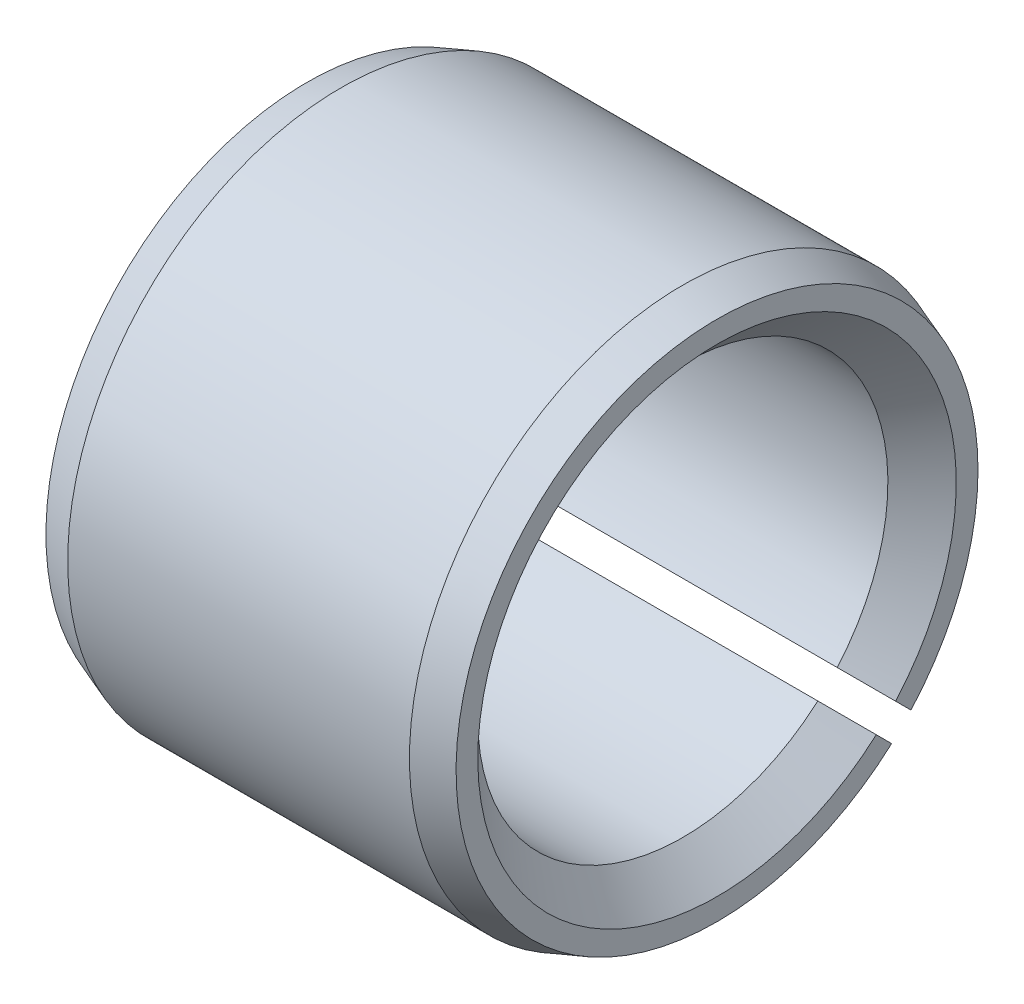
ISO-10303-21;
HEADER;
FILE_DESCRIPTION(('STEP AP214'),'2;1');
FILE_NAME('part.step','',(''),(''),'','','');
FILE_SCHEMA(('AUTOMOTIVE_DESIGN { 1 0 10303 214 1 1 1 1 }'));
ENDSEC;
DATA;
#1=APPLICATION_CONTEXT('core data for automotive mechanical design processes');
#2=APPLICATION_PROTOCOL_DEFINITION('international standard','automotive_design',2000,#1);
#3=PRODUCT_CONTEXT('',#1,'mechanical');
#4=PRODUCT('Part','Part','',(#3));
#5=PRODUCT_RELATED_PRODUCT_CATEGORY('part','',(#4));
#6=PRODUCT_DEFINITION_FORMATION('','',#4);
#7=PRODUCT_DEFINITION_CONTEXT('part definition',#1,'design');
#8=PRODUCT_DEFINITION('design','',#6,#7);
#9=PRODUCT_DEFINITION_SHAPE('','',#8);
#10=(LENGTH_UNIT() NAMED_UNIT(*) SI_UNIT(.MILLI.,.METRE.));
#11=(NAMED_UNIT(*) PLANE_ANGLE_UNIT() SI_UNIT($,.RADIAN.));
#12=(NAMED_UNIT(*) SI_UNIT($,.STERADIAN.) SOLID_ANGLE_UNIT());
#13=UNCERTAINTY_MEASURE_WITH_UNIT(LENGTH_MEASURE(1.E-05),#10,'distance_accuracy_value','');
#14=(GEOMETRIC_REPRESENTATION_CONTEXT(3) GLOBAL_UNCERTAINTY_ASSIGNED_CONTEXT((#13)) GLOBAL_UNIT_ASSIGNED_CONTEXT((#10,
#11,#12)) REPRESENTATION_CONTEXT('',''));
#15=CARTESIAN_POINT('',(0.,0.,0.));
#16=DIRECTION('',(0.,0.,1.));
#17=DIRECTION('',(1.,0.,0.));
#18=AXIS2_PLACEMENT_3D('',#15,#16,#17);
#19=CARTESIAN_POINT('',(0.5,0.,0.));
#20=DIRECTION('',(1.,0.,0.));
#21=DIRECTION('',(0.,0.,-1.));
#22=AXIS2_PLACEMENT_3D('',#19,#20,#21);
#23=CONICAL_SURFACE('',#22,4.,0.349065850398865);
#24=CARTESIAN_POINT('',(0.5,0.,0.));
#25=DIRECTION('',(1.,0.,0.));
#26=DIRECTION('',(0.,0.,-1.));
#27=AXIS2_PLACEMENT_3D('',#24,#25,#26);
#28=CIRCLE('',#27,4.);
#29=CARTESIAN_POINT('',(0.5,-2.6834680221278,-2.96631073460242));
#30=VERTEX_POINT('',#29);
#31=CARTESIAN_POINT('',(0.5,-2.96631073460242,-2.6834680221278));
#32=VERTEX_POINT('',#31);
#33=EDGE_CURVE('E39',#30,#32,#28,.T.);
#34=ORIENTED_EDGE('',*,*,#33,.F.);
#35=CARTESIAN_POINT('',(0.5,-2.6834680221278,-2.96631073460242));
#36=CARTESIAN_POINT('',(0.333332166032816,-2.64051969923893,-2.92336241171355));
#37=CARTESIAN_POINT('',(0.166665443594881,-2.59756921974541,-2.88041193222003));
#38=CARTESIAN_POINT('',(0.,-2.55461625902264,-2.83745897149726));
#39=(BOUNDED_CURVE() B_SPLINE_CURVE(3,(#35,#36,#37,#38),.UNSPECIFIED.,.F.,
.F.) B_SPLINE_CURVE_WITH_KNOTS((4,4),(2.12866750886404E-07,0.000532383472581962),
.UNSPECIFIED.) CURVE() GEOMETRIC_REPRESENTATION_ITEM() RATIONAL_B_SPLINE_CURVE((1.,1.,1.,1.)) REPRESENTATION_ITEM(''));
#40=CARTESIAN_POINT('',(0.,-2.55461625902264,-2.83745897149726));
#41=VERTEX_POINT('',#40);
#42=EDGE_CURVE('E11',#30,#41,#39,.T.);
#43=ORIENTED_EDGE('',*,*,#42,.T.);
#44=CARTESIAN_POINT('',(0.,0.,0.));
#45=DIRECTION('',(1.,0.,0.));
#46=DIRECTION('',(0.,0.,-1.));
#47=AXIS2_PLACEMENT_3D('',#44,#45,#46);
#48=CIRCLE('',#47,3.8180148828669);
#49=CARTESIAN_POINT('',(0.,-2.83745897149726,-2.55461625902264));
#50=VERTEX_POINT('',#49);
#51=EDGE_CURVE('E27',#41,#50,#48,.T.);
#52=ORIENTED_EDGE('',*,*,#51,.T.);
#53=CARTESIAN_POINT('',(0.,-2.83745897149726,-2.55461625902264));
#54=CARTESIAN_POINT('',(0.166665443594881,-2.88041193222003,-2.59756921974541));
#55=CARTESIAN_POINT('',(0.333332166032816,-2.92336241171355,-2.64051969923893));
#56=CARTESIAN_POINT('',(0.5,-2.96631073460242,-2.6834680221278));
#57=(BOUNDED_CURVE() B_SPLINE_CURVE(3,(#53,#54,#55,#56),.UNSPECIFIED.,.F.,
.F.) B_SPLINE_CURVE_WITH_KNOTS((4,4),(2.12869805117319E-07,0.000532383475636193),
.UNSPECIFIED.) CURVE() GEOMETRIC_REPRESENTATION_ITEM() RATIONAL_B_SPLINE_CURVE((1.,1.,1.,1.)) REPRESENTATION_ITEM(''));
#58=EDGE_CURVE('E169',#50,#32,#57,.T.);
#59=ORIENTED_EDGE('',*,*,#58,.T.);
#60=EDGE_LOOP('',(#34,#43,#52,#59));
#61=FACE_BOUND('',#60,.T.);
#62=ADVANCED_FACE('F16',(#61),#23,.T.);
#63=CARTESIAN_POINT('',(0.,3.8180148828669,0.));
#64=DIRECTION('',(-1.,0.,0.));
#65=DIRECTION('',(0.,0.,1.));
#66=AXIS2_PLACEMENT_3D('',#63,#64,#65);
#67=PLANE('',#66);
#68=ORIENTED_EDGE('',*,*,#51,.F.);
#69=DIRECTION('',(0.,0.707106781186547,0.707106781186548));
#70=VECTOR('',#69,1.);
#71=CARTESIAN_POINT('',(0.,-5.51543289325507,-5.79827560572969));
#72=LINE('',#71,#70);
#73=CARTESIAN_POINT('',(0.,-2.32940846388386,-2.61225117635848));
#74=VERTEX_POINT('',#73);
#75=EDGE_CURVE('E128',#41,#74,#72,.T.);
#76=ORIENTED_EDGE('',*,*,#75,.T.);
#77=CARTESIAN_POINT('',(0.,0.,0.));
#78=DIRECTION('',(1.,0.,0.));
#79=DIRECTION('',(0.,0.,-1.));
#80=AXIS2_PLACEMENT_3D('',#77,#78,#79);
#81=CIRCLE('',#80,3.5);
#82=CARTESIAN_POINT('',(0.,-2.61225117635848,-2.32940846388386));
#83=VERTEX_POINT('',#82);
#84=EDGE_CURVE('E121',#74,#83,#81,.T.);
#85=ORIENTED_EDGE('',*,*,#84,.T.);
#86=DIRECTION('',(0.,-0.707106781186548,-0.707106781186547));
#87=VECTOR('',#86,1.);
#88=CARTESIAN_POINT('',(0.,-0.141421356237309,0.141421356237309));
#89=LINE('',#88,#87);
#90=EDGE_CURVE('E129',#83,#50,#89,.T.);
#91=ORIENTED_EDGE('',*,*,#90,.T.);
#92=EDGE_LOOP('',(#68,#76,#85,#91));
#93=FACE_BOUND('',#92,.T.);
#94=ADVANCED_FACE('F182',(#93),#67,.T.);
#95=CARTESIAN_POINT('',(0.,0.,0.));
#96=DIRECTION('',(-1.,0.,0.));
#97=DIRECTION('',(0.,0.,1.));
#98=AXIS2_PLACEMENT_3D('',#95,#96,#97);
#99=CONICAL_SURFACE('',#98,3.5,0.785398163397448);
#100=ORIENTED_EDGE('',*,*,#84,.F.);
#101=CARTESIAN_POINT('',(0.,-2.32940846388386,-2.61225117635848));
#102=CARTESIAN_POINT('',(0.166689557115198,-2.21134823870117,-2.49419095117579));
#103=CARTESIAN_POINT('',(0.333360046715191,-2.09327465909982,-2.37611737157444));
#104=CARTESIAN_POINT('',(0.5,-1.97517969261436,-2.25802240508898));
#105=(BOUNDED_CURVE() B_SPLINE_CURVE(3,(#101,#102,#103,#104),.UNSPECIFIED.,.F.,
.F.) B_SPLINE_CURVE_WITH_KNOTS((4,4),(9.90751980755594E-07,0.000708768049468819),
.UNSPECIFIED.) CURVE() GEOMETRIC_REPRESENTATION_ITEM() RATIONAL_B_SPLINE_CURVE((1.,1.,1.,1.)) REPRESENTATION_ITEM(''));
#106=CARTESIAN_POINT('',(0.5,-1.97517969261436,-2.25802240508898));
#107=VERTEX_POINT('',#106);
#108=EDGE_CURVE('E149',#74,#107,#105,.T.);
#109=ORIENTED_EDGE('',*,*,#108,.T.);
#110=CARTESIAN_POINT('',(0.5,0.,0.));
#111=DIRECTION('',(1.,0.,0.));
#112=DIRECTION('',(0.,0.,-1.));
#113=AXIS2_PLACEMENT_3D('',#110,#111,#112);
#114=CIRCLE('',#113,3.);
#115=CARTESIAN_POINT('',(0.5,-2.25802240508898,-1.97517969261436));
#116=VERTEX_POINT('',#115);
#117=EDGE_CURVE('E119',#107,#116,#114,.T.);
#118=ORIENTED_EDGE('',*,*,#117,.T.);
#119=CARTESIAN_POINT('',(0.5,-2.25802240508898,-1.97517969261436));
#120=CARTESIAN_POINT('',(0.333359948184679,-2.37611744140137,-2.09327472892675));
#121=CARTESIAN_POINT('',(0.166689472660281,-2.49419101099218,-2.21134829851756));
#122=CARTESIAN_POINT('',(0.,-2.61225117635848,-2.32940846388386));
#123=(BOUNDED_CURVE() B_SPLINE_CURVE(3,(#119,#120,#121,#122),.UNSPECIFIED.,.F.,
.F.) B_SPLINE_CURVE_WITH_KNOTS((4,4),(0.0041340243565896,0.00484453819835573),
.UNSPECIFIED.) CURVE() GEOMETRIC_REPRESENTATION_ITEM() RATIONAL_B_SPLINE_CURVE((1.,1.,1.,1.)) REPRESENTATION_ITEM(''));
#124=EDGE_CURVE('E113',#116,#83,#123,.T.);
#125=ORIENTED_EDGE('',*,*,#124,.T.);
#126=EDGE_LOOP('',(#100,#109,#118,#125));
#127=FACE_BOUND('',#126,.T.);
#128=ADVANCED_FACE('F234',(#127),#99,.F.);
#129=CARTESIAN_POINT('',(6.,0.,0.));
#130=DIRECTION('',(1.,0.,0.));
#131=DIRECTION('',(0.,0.,-1.));
#132=AXIS2_PLACEMENT_3D('',#129,#130,#131);
#133=CYLINDRICAL_SURFACE('',#132,3.);
#134=ORIENTED_EDGE('',*,*,#117,.F.);
#135=DIRECTION('',(1.,0.,0.));
#136=VECTOR('',#135,1.);
#137=CARTESIAN_POINT('',(6.,-1.97517969261436,-2.25802240508898));
#138=LINE('',#137,#136);
#139=CARTESIAN_POINT('',(5.5,-1.97517969261436,-2.25802240508898));
#140=VERTEX_POINT('',#139);
#141=EDGE_CURVE('E120',#107,#140,#138,.T.);
#142=ORIENTED_EDGE('',*,*,#141,.T.);
#143=CARTESIAN_POINT('',(5.5,0.,0.));
#144=DIRECTION('',(1.,0.,0.));
#145=DIRECTION('',(0.,0.,-1.));
#146=AXIS2_PLACEMENT_3D('',#143,#144,#145);
#147=CIRCLE('',#146,3.);
#148=CARTESIAN_POINT('',(5.5,-2.25802240508898,-1.97517969261436));
#149=VERTEX_POINT('',#148);
#150=EDGE_CURVE('E175',#140,#149,#147,.T.);
#151=ORIENTED_EDGE('',*,*,#150,.T.);
#152=DIRECTION('',(-1.,0.,0.));
#153=VECTOR('',#152,1.);
#154=CARTESIAN_POINT('',(6.,-2.25802240508898,-1.97517969261436));
#155=LINE('',#154,#153);
#156=EDGE_CURVE('E205',#149,#116,#155,.T.);
#157=ORIENTED_EDGE('',*,*,#156,.T.);
#158=EDGE_LOOP('',(#134,#142,#151,#157));
#159=FACE_BOUND('',#158,.T.);
#160=ADVANCED_FACE('F243',(#159),#133,.F.);
#161=CARTESIAN_POINT('',(5.5,0.,0.));
#162=DIRECTION('',(1.,0.,0.));
#163=DIRECTION('',(0.,0.,-1.));
#164=AXIS2_PLACEMENT_3D('',#161,#162,#163);
#165=CONICAL_SURFACE('',#164,3.,0.785398163397448);
#166=ORIENTED_EDGE('',*,*,#150,.F.);
#167=CARTESIAN_POINT('',(5.5,-1.97517969261436,-2.25802240508898));
#168=CARTESIAN_POINT('',(5.66664005181532,-2.09327472892675,-2.37611744140137));
#169=CARTESIAN_POINT('',(5.83331052733972,-2.21134829851756,-2.49419101099218));
#170=CARTESIAN_POINT('',(6.,-2.32940846388386,-2.61225117635848));
#171=(BOUNDED_CURVE() B_SPLINE_CURVE(3,(#167,#168,#169,#170),.UNSPECIFIED.,.F.,
.F.) B_SPLINE_CURVE_WITH_KNOTS((4,4),(0.0041340243565896,0.00484453819835574),
.UNSPECIFIED.) CURVE() GEOMETRIC_REPRESENTATION_ITEM() RATIONAL_B_SPLINE_CURVE((1.,1.,1.,1.)) REPRESENTATION_ITEM(''));
#172=CARTESIAN_POINT('',(6.,-2.32940846388386,-2.61225117635848));
#173=VERTEX_POINT('',#172);
#174=EDGE_CURVE('E134',#140,#173,#171,.T.);
#175=ORIENTED_EDGE('',*,*,#174,.T.);
#176=CARTESIAN_POINT('',(6.,0.,0.));
#177=DIRECTION('',(1.,0.,0.));
#178=DIRECTION('',(0.,0.,-1.));
#179=AXIS2_PLACEMENT_3D('',#176,#177,#178);
#180=CIRCLE('',#179,3.5);
#181=CARTESIAN_POINT('',(6.,-2.61225117635848,-2.32940846388386));
#182=VERTEX_POINT('',#181);
#183=EDGE_CURVE('E130',#173,#182,#180,.T.);
#184=ORIENTED_EDGE('',*,*,#183,.T.);
#185=CARTESIAN_POINT('',(6.,-2.61225117635848,-2.32940846388386));
#186=CARTESIAN_POINT('',(5.8333104428848,-2.49419095117579,-2.21134823870117));
#187=CARTESIAN_POINT('',(5.66663995328481,-2.37611737157444,-2.09327465909982));
#188=CARTESIAN_POINT('',(5.5,-2.25802240508898,-1.97517969261436));
#189=(BOUNDED_CURVE() B_SPLINE_CURVE(3,(#185,#186,#187,#188),.UNSPECIFIED.,.F.,
.F.) B_SPLINE_CURVE_WITH_KNOTS((4,4),(9.90751980755632E-07,0.000708768049468819),
.UNSPECIFIED.) CURVE() GEOMETRIC_REPRESENTATION_ITEM() RATIONAL_B_SPLINE_CURVE((1.,1.,1.,1.)) REPRESENTATION_ITEM(''));
#190=EDGE_CURVE('E135',#182,#149,#189,.T.);
#191=ORIENTED_EDGE('',*,*,#190,.T.);
#192=EDGE_LOOP('',(#166,#175,#184,#191));
#193=FACE_BOUND('',#192,.T.);
#194=ADVANCED_FACE('F264',(#193),#165,.F.);
#195=CARTESIAN_POINT('',(6.,3.5,0.));
#196=DIRECTION('',(1.,0.,0.));
#197=DIRECTION('',(0.,1.,0.));
#198=AXIS2_PLACEMENT_3D('',#195,#196,#197);
#199=PLANE('',#198);
#200=ORIENTED_EDGE('',*,*,#183,.F.);
#201=DIRECTION('',(0.,0.707106781186547,0.707106781186548));
#202=VECTOR('',#201,1.);
#203=CARTESIAN_POINT('',(6.,-5.51543289325507,-5.79827560572969));
#204=LINE('',#203,#202);
#205=CARTESIAN_POINT('',(6.,-2.55461625902264,-2.83745897149726));
#206=VERTEX_POINT('',#205);
#207=EDGE_CURVE('E101',#206,#173,#204,.T.);
#208=ORIENTED_EDGE('',*,*,#207,.F.);
#209=CARTESIAN_POINT('',(6.,0.,0.));
#210=DIRECTION('',(1.,0.,0.));
#211=DIRECTION('',(0.,0.,-1.));
#212=AXIS2_PLACEMENT_3D('',#209,#210,#211);
#213=CIRCLE('',#212,3.8180148828669);
#214=CARTESIAN_POINT('',(6.,-2.83745897149726,-2.55461625902264));
#215=VERTEX_POINT('',#214);
#216=EDGE_CURVE('E141',#206,#215,#213,.T.);
#217=ORIENTED_EDGE('',*,*,#216,.T.);
#218=DIRECTION('',(0.,-0.707106781186548,-0.707106781186547));
#219=VECTOR('',#218,1.);
#220=CARTESIAN_POINT('',(6.,-0.141421356237309,0.141421356237309));
#221=LINE('',#220,#219);
#222=EDGE_CURVE('E82',#182,#215,#221,.T.);
#223=ORIENTED_EDGE('',*,*,#222,.F.);
#224=EDGE_LOOP('',(#200,#208,#217,#223));
#225=FACE_BOUND('',#224,.T.);
#226=ADVANCED_FACE('F269',(#225),#199,.T.);
#227=CARTESIAN_POINT('',(6.,0.,0.));
#228=DIRECTION('',(-1.,0.,0.));
#229=DIRECTION('',(0.,0.,1.));
#230=AXIS2_PLACEMENT_3D('',#227,#228,#229);
#231=CONICAL_SURFACE('',#230,3.8180148828669,0.349065850398865);
#232=ORIENTED_EDGE('',*,*,#216,.F.);
#233=CARTESIAN_POINT('',(6.,-2.55461625902264,-2.83745897149726));
#234=CARTESIAN_POINT('',(5.83333455640512,-2.59756921974541,-2.88041193222003));
#235=CARTESIAN_POINT('',(5.66666783396718,-2.64051969923893,-2.92336241171355));
#236=CARTESIAN_POINT('',(5.5,-2.6834680221278,-2.96631073460242));
#237=(BOUNDED_CURVE() B_SPLINE_CURVE(3,(#233,#234,#235,#236),.UNSPECIFIED.,.F.,
.F.) B_SPLINE_CURVE_WITH_KNOTS((4,4),(2.12869805117381E-07,0.000532383475636193),
.UNSPECIFIED.) CURVE() GEOMETRIC_REPRESENTATION_ITEM() RATIONAL_B_SPLINE_CURVE((1.,1.,1.,1.)) REPRESENTATION_ITEM(''));
#238=CARTESIAN_POINT('',(5.5,-2.6834680221278,-2.96631073460242));
#239=VERTEX_POINT('',#238);
#240=EDGE_CURVE('E93',#206,#239,#237,.T.);
#241=ORIENTED_EDGE('',*,*,#240,.T.);
#242=CARTESIAN_POINT('',(5.5,0.,0.));
#243=DIRECTION('',(1.,0.,0.));
#244=DIRECTION('',(0.,0.,-1.));
#245=AXIS2_PLACEMENT_3D('',#242,#243,#244);
#246=CIRCLE('',#245,4.);
#247=CARTESIAN_POINT('',(5.5,-2.96631073460242,-2.6834680221278));
#248=VERTEX_POINT('',#247);
#249=EDGE_CURVE('E87',#239,#248,#246,.T.);
#250=ORIENTED_EDGE('',*,*,#249,.T.);
#251=CARTESIAN_POINT('',(5.5,-2.96631073460242,-2.6834680221278));
#252=CARTESIAN_POINT('',(5.66666783396718,-2.92336241171355,-2.64051969923893));
#253=CARTESIAN_POINT('',(5.83333455640512,-2.88041193222003,-2.59756921974541));
#254=CARTESIAN_POINT('',(6.,-2.83745897149726,-2.55461625902264));
#255=(BOUNDED_CURVE() B_SPLINE_CURVE(3,(#251,#252,#253,#254),.UNSPECIFIED.,.F.,
.F.) B_SPLINE_CURVE_WITH_KNOTS((4,4),(2.12866750886302E-07,0.000532383472581962),
.UNSPECIFIED.) CURVE() GEOMETRIC_REPRESENTATION_ITEM() RATIONAL_B_SPLINE_CURVE((1.,1.,1.,1.)) REPRESENTATION_ITEM(''));
#256=EDGE_CURVE('E75',#248,#215,#255,.T.);
#257=ORIENTED_EDGE('',*,*,#256,.T.);
#258=EDGE_LOOP('',(#232,#241,#250,#257));
#259=FACE_BOUND('',#258,.T.);
#260=ADVANCED_FACE('F91',(#259),#231,.T.);
#261=CARTESIAN_POINT('',(6.,0.,0.));
#262=DIRECTION('',(1.,0.,0.));
#263=DIRECTION('',(0.,0.,-1.));
#264=AXIS2_PLACEMENT_3D('',#261,#262,#263);
#265=CYLINDRICAL_SURFACE('',#264,4.);
#266=ORIENTED_EDGE('',*,*,#249,.F.);
#267=DIRECTION('',(-1.,0.,0.));
#268=VECTOR('',#267,1.);
#269=CARTESIAN_POINT('',(6.,-2.6834680221278,-2.96631073460242));
#270=LINE('',#269,#268);
#271=EDGE_CURVE('E88',#239,#30,#270,.T.);
#272=ORIENTED_EDGE('',*,*,#271,.T.);
#273=ORIENTED_EDGE('',*,*,#33,.T.);
#274=DIRECTION('',(1.,0.,0.));
#275=VECTOR('',#274,1.);
#276=CARTESIAN_POINT('',(6.,-2.96631073460242,-2.6834680221278));
#277=LINE('',#276,#275);
#278=EDGE_CURVE('E80',#32,#248,#277,.T.);
#279=ORIENTED_EDGE('',*,*,#278,.T.);
#280=EDGE_LOOP('',(#266,#272,#273,#279));
#281=FACE_BOUND('',#280,.T.);
#282=ADVANCED_FACE('F99',(#281),#265,.T.);
#283=CARTESIAN_POINT('',(6.,-5.51543289325507,-5.79827560572969));
#284=DIRECTION('',(0.,-0.707106781186548,0.707106781186547));
#285=DIRECTION('',(-1.,0.,0.));
#286=AXIS2_PLACEMENT_3D('',#283,#284,#285);
#287=PLANE('',#286);
#288=ORIENTED_EDGE('',*,*,#75,.F.);
#289=ORIENTED_EDGE('',*,*,#42,.F.);
#290=ORIENTED_EDGE('',*,*,#271,.F.);
#291=ORIENTED_EDGE('',*,*,#240,.F.);
#292=ORIENTED_EDGE('',*,*,#207,.T.);
#293=ORIENTED_EDGE('',*,*,#174,.F.);
#294=ORIENTED_EDGE('',*,*,#141,.F.);
#295=ORIENTED_EDGE('',*,*,#108,.F.);
#296=EDGE_LOOP('',(#288,#289,#290,#291,#292,#293,#294,#295));
#297=FACE_BOUND('',#296,.T.);
#298=ADVANCED_FACE('F251',(#297),#287,.T.);
#299=CARTESIAN_POINT('',(6.,-0.141421356237309,0.141421356237309));
#300=DIRECTION('',(0.,0.707106781186547,-0.707106781186548));
#301=DIRECTION('',(-1.,0.,0.));
#302=AXIS2_PLACEMENT_3D('',#299,#300,#301);
#303=PLANE('',#302);
#304=ORIENTED_EDGE('',*,*,#156,.F.);
#305=ORIENTED_EDGE('',*,*,#190,.F.);
#306=ORIENTED_EDGE('',*,*,#222,.T.);
#307=ORIENTED_EDGE('',*,*,#256,.F.);
#308=ORIENTED_EDGE('',*,*,#278,.F.);
#309=ORIENTED_EDGE('',*,*,#58,.F.);
#310=ORIENTED_EDGE('',*,*,#90,.F.);
#311=ORIENTED_EDGE('',*,*,#124,.F.);
#312=EDGE_LOOP('',(#304,#305,#306,#307,#308,#309,#310,#311));
#313=FACE_BOUND('',#312,.T.);
#314=ADVANCED_FACE('F78',(#313),#303,.T.);
#315=CLOSED_SHELL('',(#62,#94,#128,#160,#194,#226,#260,#282,#298,#314));
#316=MANIFOLD_SOLID_BREP('B1',#315);
#317=ADVANCED_BREP_SHAPE_REPRESENTATION('',(#18,#316),#14);
#318=SHAPE_DEFINITION_REPRESENTATION(#9,#317);
ENDSEC;
END-ISO-10303-21;
